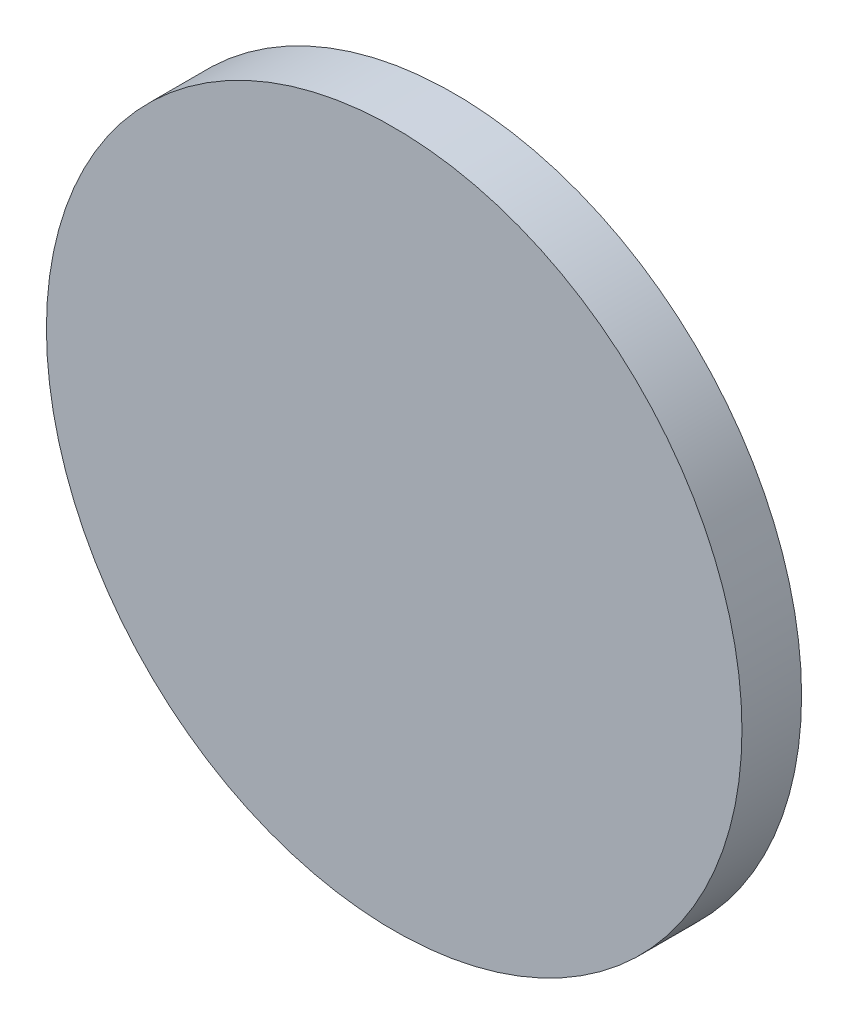
ISO-10303-21;
HEADER;
FILE_DESCRIPTION(('STEP AP214'),'2;1');
FILE_NAME('part.step','',(''),(''),'','','');
FILE_SCHEMA(('AUTOMOTIVE_DESIGN { 1 0 10303 214 1 1 1 1 }'));
ENDSEC;
DATA;
#1=APPLICATION_CONTEXT('core data for automotive mechanical design processes');
#2=APPLICATION_PROTOCOL_DEFINITION('international standard','automotive_design',2000,#1);
#3=PRODUCT_CONTEXT('',#1,'mechanical');
#4=PRODUCT('Part','Part','',(#3));
#5=PRODUCT_RELATED_PRODUCT_CATEGORY('part','',(#4));
#6=PRODUCT_DEFINITION_FORMATION('','',#4);
#7=PRODUCT_DEFINITION_CONTEXT('part definition',#1,'design');
#8=PRODUCT_DEFINITION('design','',#6,#7);
#9=PRODUCT_DEFINITION_SHAPE('','',#8);
#10=(LENGTH_UNIT() NAMED_UNIT(*) SI_UNIT(.MILLI.,.METRE.));
#11=(NAMED_UNIT(*) PLANE_ANGLE_UNIT() SI_UNIT($,.RADIAN.));
#12=(NAMED_UNIT(*) SI_UNIT($,.STERADIAN.) SOLID_ANGLE_UNIT());
#13=UNCERTAINTY_MEASURE_WITH_UNIT(LENGTH_MEASURE(1.E-05),#10,'distance_accuracy_value','');
#14=(GEOMETRIC_REPRESENTATION_CONTEXT(3) GLOBAL_UNCERTAINTY_ASSIGNED_CONTEXT((#13)) GLOBAL_UNIT_ASSIGNED_CONTEXT((#10,
#11,#12)) REPRESENTATION_CONTEXT('',''));
#15=CARTESIAN_POINT('',(0.,0.,0.));
#16=DIRECTION('',(0.,0.,1.));
#17=DIRECTION('',(1.,0.,0.));
#18=AXIS2_PLACEMENT_3D('',#15,#16,#17);
#19=CARTESIAN_POINT('',(5.80008,4.597,0.79916));
#20=DIRECTION('',(0.,0.,1.));
#21=DIRECTION('',(1.,0.,0.));
#22=AXIS2_PLACEMENT_3D('',#19,#20,#21);
#23=PLANE('',#22);
#24=CARTESIAN_POINT('',(5.80008,4.597,0.79916));
#25=DIRECTION('',(0.,0.,1.));
#26=DIRECTION('',(1.,0.,0.));
#27=AXIS2_PLACEMENT_3D('',#24,#25,#26);
#28=CIRCLE('',#27,0.200024667);
#29=CARTESIAN_POINT('',(6.000104667,4.597,0.79916));
#30=VERTEX_POINT('',#29);
#31=EDGE_CURVE('E18',#30,#30,#28,.F.);
#32=ORIENTED_EDGE('',*,*,#31,.F.);
#33=EDGE_LOOP('',(#32));
#34=FACE_BOUND('',#33,.T.);
#35=ADVANCED_FACE('F15',(#34),#23,.T.);
#36=CARTESIAN_POINT('',(5.80008,4.597,0.76487));
#37=DIRECTION('',(0.,0.,1.));
#38=DIRECTION('',(1.,0.,0.));
#39=AXIS2_PLACEMENT_3D('',#36,#37,#38);
#40=CYLINDRICAL_SURFACE('',#39,0.200024667);
#41=ORIENTED_EDGE('',*,*,#31,.T.);
#42=EDGE_LOOP('',(#41));
#43=FACE_BOUND('',#42,.T.);
#44=CARTESIAN_POINT('',(5.80008,4.597,0.76487));
#45=DIRECTION('',(0.,0.,1.));
#46=DIRECTION('',(1.,0.,0.));
#47=AXIS2_PLACEMENT_3D('',#44,#45,#46);
#48=CIRCLE('',#47,0.200024667);
#49=CARTESIAN_POINT('',(6.000104667,4.597,0.76487));
#50=VERTEX_POINT('',#49);
#51=EDGE_CURVE('E10',#50,#50,#48,.F.);
#52=ORIENTED_EDGE('',*,*,#51,.F.);
#53=EDGE_LOOP('',(#52));
#54=FACE_BOUND('',#53,.T.);
#55=ADVANCED_FACE('F27',(#43,#54),#40,.T.);
#56=CARTESIAN_POINT('',(5.80008,4.597,0.76487));
#57=DIRECTION('',(0.,0.,-1.));
#58=DIRECTION('',(-1.,0.,0.));
#59=AXIS2_PLACEMENT_3D('',#56,#57,#58);
#60=PLANE('',#59);
#61=ORIENTED_EDGE('',*,*,#51,.T.);
#62=EDGE_LOOP('',(#61));
#63=FACE_BOUND('',#62,.T.);
#64=ADVANCED_FACE('F35',(#63),#60,.T.);
#65=CLOSED_SHELL('',(#35,#55,#64));
#66=MANIFOLD_SOLID_BREP('B1',#65);
#67=ADVANCED_BREP_SHAPE_REPRESENTATION('',(#18,#66),#14);
#68=SHAPE_DEFINITION_REPRESENTATION(#9,#67);
ENDSEC;
END-ISO-10303-21;
